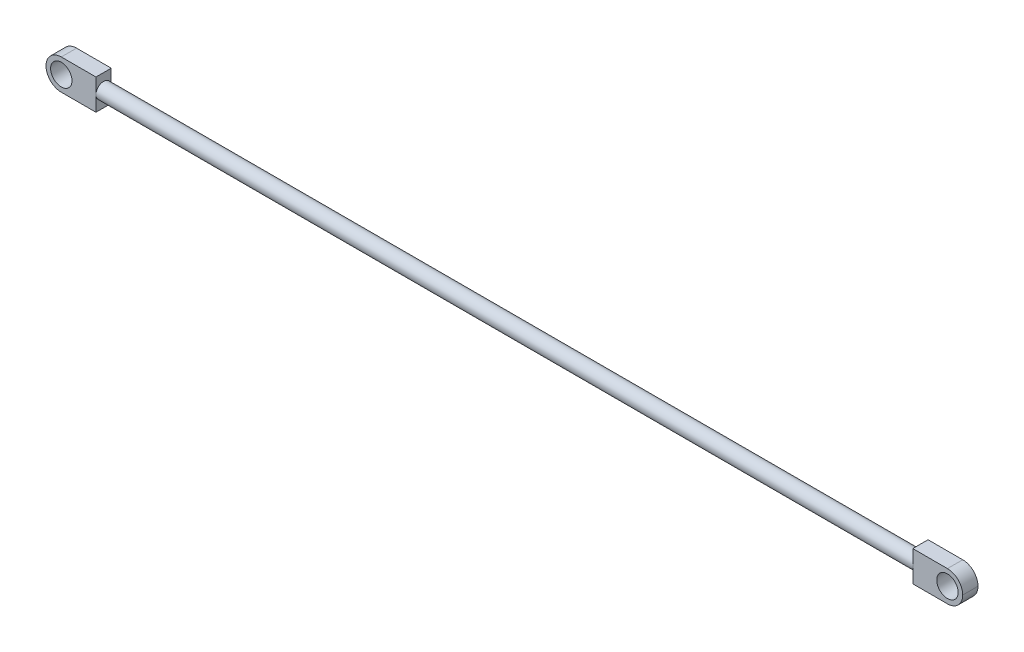
ISO-10303-21;
HEADER;
FILE_DESCRIPTION(('STEP AP214'),'2;1');
FILE_NAME('part.step','',(''),(''),'','','');
FILE_SCHEMA(('AUTOMOTIVE_DESIGN { 1 0 10303 214 1 1 1 1 }'));
ENDSEC;
DATA;
#1=APPLICATION_CONTEXT('core data for automotive mechanical design processes');
#2=APPLICATION_PROTOCOL_DEFINITION('international standard','automotive_design',2000,#1);
#3=PRODUCT_CONTEXT('',#1,'mechanical');
#4=PRODUCT('Part','Part','',(#3));
#5=PRODUCT_RELATED_PRODUCT_CATEGORY('part','',(#4));
#6=PRODUCT_DEFINITION_FORMATION('','',#4);
#7=PRODUCT_DEFINITION_CONTEXT('part definition',#1,'design');
#8=PRODUCT_DEFINITION('design','',#6,#7);
#9=PRODUCT_DEFINITION_SHAPE('','',#8);
#10=(LENGTH_UNIT() NAMED_UNIT(*) SI_UNIT(.MILLI.,.METRE.));
#11=(NAMED_UNIT(*) PLANE_ANGLE_UNIT() SI_UNIT($,.RADIAN.));
#12=(NAMED_UNIT(*) SI_UNIT($,.STERADIAN.) SOLID_ANGLE_UNIT());
#13=UNCERTAINTY_MEASURE_WITH_UNIT(LENGTH_MEASURE(1.E-05),#10,'distance_accuracy_value','');
#14=(GEOMETRIC_REPRESENTATION_CONTEXT(3) GLOBAL_UNCERTAINTY_ASSIGNED_CONTEXT((#13)) GLOBAL_UNIT_ASSIGNED_CONTEXT((#10,
#11,#12)) REPRESENTATION_CONTEXT('',''));
#15=CARTESIAN_POINT('',(0.,0.,0.));
#16=DIRECTION('',(0.,0.,1.));
#17=DIRECTION('',(1.,0.,0.));
#18=AXIS2_PLACEMENT_3D('',#15,#16,#17);
#19=CARTESIAN_POINT('',(267.298147640469,-20.9331098604644,19.));
#20=DIRECTION('',(-1.,0.,0.));
#21=DIRECTION('',(0.,0.,1.));
#22=AXIS2_PLACEMENT_3D('',#19,#20,#21);
#23=PLANE('',#22);
#24=DIRECTION('',(0.,1.,0.));
#25=VECTOR('',#24,1.);
#26=CARTESIAN_POINT('',(267.298147640469,0.,10.));
#27=LINE('',#26,#25);
#28=CARTESIAN_POINT('',(267.298147640469,-10.,10.));
#29=VERTEX_POINT('',#28);
#30=CARTESIAN_POINT('',(267.298147640469,0.,10.));
#31=VERTEX_POINT('',#30);
#32=EDGE_CURVE('E213',#29,#31,#27,.T.);
#33=ORIENTED_EDGE('',*,*,#32,.T.);
#34=CARTESIAN_POINT('',(267.298147640469,0.,5.));
#35=DIRECTION('',(-1.,0.,0.));
#36=DIRECTION('',(0.,0.,1.));
#37=AXIS2_PLACEMENT_3D('',#34,#35,#36);
#38=CIRCLE('',#37,5.);
#39=CARTESIAN_POINT('',(267.298147640469,0.,0.));
#40=VERTEX_POINT('',#39);
#41=EDGE_CURVE('E11',#31,#40,#38,.F.);
#42=ORIENTED_EDGE('',*,*,#41,.T.);
#43=DIRECTION('',(0.,1.,0.));
#44=VECTOR('',#43,1.);
#45=CARTESIAN_POINT('',(267.298147640469,-20.9331098604644,0.));
#46=LINE('',#45,#44);
#47=CARTESIAN_POINT('',(267.298147640469,-10.,0.));
#48=VERTEX_POINT('',#47);
#49=EDGE_CURVE('E198',#48,#40,#46,.T.);
#50=ORIENTED_EDGE('',*,*,#49,.F.);
#51=DIRECTION('',(0.,0.,1.));
#52=VECTOR('',#51,1.);
#53=CARTESIAN_POINT('',(267.298147640469,-10.,10.));
#54=LINE('',#53,#52);
#55=EDGE_CURVE('E178',#48,#29,#54,.T.);
#56=ORIENTED_EDGE('',*,*,#55,.T.);
#57=EDGE_LOOP('',(#33,#42,#50,#56));
#58=FACE_BOUND('',#57,.T.);
#59=ADVANCED_FACE('F35',(#58),#23,.T.);
#60=CARTESIAN_POINT('',(0.,0.,10.));
#61=DIRECTION('',(0.,0.,-1.));
#62=DIRECTION('',(-1.,0.,0.));
#63=AXIS2_PLACEMENT_3D('',#60,#61,#62);
#64=PLANE('',#63);
#65=CARTESIAN_POINT('',(290.,0.,10.));
#66=DIRECTION('',(0.,0.,1.));
#67=DIRECTION('',(1.,0.,0.));
#68=AXIS2_PLACEMENT_3D('',#65,#66,#67);
#69=CIRCLE('',#68,6.99999999999999);
#70=CARTESIAN_POINT('',(297.,0.,10.));
#71=VERTEX_POINT('',#70);
#72=EDGE_CURVE('E185',#71,#71,#69,.T.);
#73=ORIENTED_EDGE('',*,*,#72,.F.);
#74=EDGE_LOOP('',(#73));
#75=FACE_BOUND('',#74,.T.);
#76=ORIENTED_EDGE('',*,*,#32,.F.);
#77=DIRECTION('',(1.,0.,0.));
#78=VECTOR('',#77,1.);
#79=CARTESIAN_POINT('',(-300.,-10.,10.));
#80=LINE('',#79,#78);
#81=CARTESIAN_POINT('',(290.,-10.,10.));
#82=VERTEX_POINT('',#81);
#83=EDGE_CURVE('E177',#29,#82,#80,.T.);
#84=ORIENTED_EDGE('',*,*,#83,.T.);
#85=CARTESIAN_POINT('',(290.,0.,10.));
#86=DIRECTION('',(0.,0.,-1.));
#87=DIRECTION('',(-1.,0.,0.));
#88=AXIS2_PLACEMENT_3D('',#85,#86,#87);
#89=CIRCLE('',#88,10.);
#90=CARTESIAN_POINT('',(300.,0.,10.));
#91=VERTEX_POINT('',#90);
#92=EDGE_CURVE('E193',#82,#91,#89,.F.);
#93=ORIENTED_EDGE('',*,*,#92,.T.);
#94=CARTESIAN_POINT('',(290.,0.,10.));
#95=DIRECTION('',(0.,0.,-1.));
#96=DIRECTION('',(-1.,0.,0.));
#97=AXIS2_PLACEMENT_3D('',#94,#95,#96);
#98=CIRCLE('',#97,10.);
#99=CARTESIAN_POINT('',(290.,10.,10.));
#100=VERTEX_POINT('',#99);
#101=EDGE_CURVE('E190',#91,#100,#98,.F.);
#102=ORIENTED_EDGE('',*,*,#101,.T.);
#103=DIRECTION('',(-1.,0.,0.));
#104=VECTOR('',#103,1.);
#105=CARTESIAN_POINT('',(-300.,10.,10.));
#106=LINE('',#105,#104);
#107=CARTESIAN_POINT('',(267.298147640469,10.,10.));
#108=VERTEX_POINT('',#107);
#109=EDGE_CURVE('E192',#100,#108,#106,.T.);
#110=ORIENTED_EDGE('',*,*,#109,.T.);
#111=EDGE_CURVE('E180',#31,#108,#27,.T.);
#112=ORIENTED_EDGE('',*,*,#111,.F.);
#113=EDGE_LOOP('',(#76,#84,#93,#102,#110,#112));
#114=FACE_BOUND('',#113,.T.);
#115=ADVANCED_FACE('F37',(#75,#114),#64,.F.);
#116=CARTESIAN_POINT('',(0.,0.,0.));
#117=DIRECTION('',(0.,0.,-1.));
#118=DIRECTION('',(-1.,0.,0.));
#119=AXIS2_PLACEMENT_3D('',#116,#117,#118);
#120=PLANE('',#119);
#121=CARTESIAN_POINT('',(290.,0.,0.));
#122=DIRECTION('',(0.,0.,1.));
#123=DIRECTION('',(1.,0.,0.));
#124=AXIS2_PLACEMENT_3D('',#121,#122,#123);
#125=CIRCLE('',#124,6.99999999999999);
#126=CARTESIAN_POINT('',(297.,0.,0.));
#127=VERTEX_POINT('',#126);
#128=EDGE_CURVE('E205',#127,#127,#125,.T.);
#129=ORIENTED_EDGE('',*,*,#128,.T.);
#130=EDGE_LOOP('',(#129));
#131=FACE_BOUND('',#130,.T.);
#132=DIRECTION('',(1.,0.,0.));
#133=VECTOR('',#132,1.);
#134=CARTESIAN_POINT('',(-300.,-10.,0.));
#135=LINE('',#134,#133);
#136=CARTESIAN_POINT('',(290.,-10.,0.));
#137=VERTEX_POINT('',#136);
#138=EDGE_CURVE('E189',#48,#137,#135,.T.);
#139=ORIENTED_EDGE('',*,*,#138,.F.);
#140=ORIENTED_EDGE('',*,*,#49,.T.);
#141=CARTESIAN_POINT('',(267.298147640469,10.,0.));
#142=VERTEX_POINT('',#141);
#143=EDGE_CURVE('E208',#40,#142,#46,.T.);
#144=ORIENTED_EDGE('',*,*,#143,.T.);
#145=DIRECTION('',(-1.,0.,0.));
#146=VECTOR('',#145,1.);
#147=CARTESIAN_POINT('',(-300.,10.,0.));
#148=LINE('',#147,#146);
#149=CARTESIAN_POINT('',(290.,10.,0.));
#150=VERTEX_POINT('',#149);
#151=EDGE_CURVE('E204',#150,#142,#148,.T.);
#152=ORIENTED_EDGE('',*,*,#151,.F.);
#153=CARTESIAN_POINT('',(290.,0.,0.));
#154=DIRECTION('',(0.,0.,-1.));
#155=DIRECTION('',(-1.,0.,0.));
#156=AXIS2_PLACEMENT_3D('',#153,#154,#155);
#157=CIRCLE('',#156,10.);
#158=CARTESIAN_POINT('',(300.,0.,0.));
#159=VERTEX_POINT('',#158);
#160=EDGE_CURVE('E195',#150,#159,#157,.T.);
#161=ORIENTED_EDGE('',*,*,#160,.T.);
#162=CARTESIAN_POINT('',(290.,0.,0.));
#163=DIRECTION('',(0.,0.,-1.));
#164=DIRECTION('',(-1.,0.,0.));
#165=AXIS2_PLACEMENT_3D('',#162,#163,#164);
#166=CIRCLE('',#165,10.);
#167=EDGE_CURVE('E197',#159,#137,#166,.T.);
#168=ORIENTED_EDGE('',*,*,#167,.T.);
#169=EDGE_LOOP('',(#139,#140,#144,#152,#161,#168));
#170=FACE_BOUND('',#169,.T.);
#171=ADVANCED_FACE('F230',(#131,#170),#120,.T.);
#172=CARTESIAN_POINT('',(-300.,10.,10.));
#173=DIRECTION('',(0.,-1.,0.));
#174=DIRECTION('',(0.,0.,-1.));
#175=AXIS2_PLACEMENT_3D('',#172,#173,#174);
#176=PLANE('',#175);
#177=DIRECTION('',(0.,0.,-1.));
#178=VECTOR('',#177,1.);
#179=CARTESIAN_POINT('',(267.298147640469,10.,10.));
#180=LINE('',#179,#178);
#181=EDGE_CURVE('E181',#108,#142,#180,.T.);
#182=ORIENTED_EDGE('',*,*,#181,.F.);
#183=ORIENTED_EDGE('',*,*,#109,.F.);
#184=DIRECTION('',(0.,0.,-1.));
#185=VECTOR('',#184,1.);
#186=CARTESIAN_POINT('',(290.,10.,10.));
#187=LINE('',#186,#185);
#188=EDGE_CURVE('E201',#100,#150,#187,.T.);
#189=ORIENTED_EDGE('',*,*,#188,.T.);
#190=ORIENTED_EDGE('',*,*,#151,.T.);
#191=EDGE_LOOP('',(#182,#183,#189,#190));
#192=FACE_BOUND('',#191,.T.);
#193=ADVANCED_FACE('F225',(#192),#176,.F.);
#194=CARTESIAN_POINT('',(-300.,-10.,10.));
#195=DIRECTION('',(0.,1.,0.));
#196=DIRECTION('',(0.,0.,1.));
#197=AXIS2_PLACEMENT_3D('',#194,#195,#196);
#198=PLANE('',#197);
#199=ORIENTED_EDGE('',*,*,#55,.F.);
#200=ORIENTED_EDGE('',*,*,#138,.T.);
#201=DIRECTION('',(0.,0.,-1.));
#202=VECTOR('',#201,1.);
#203=CARTESIAN_POINT('',(290.,-10.,10.));
#204=LINE('',#203,#202);
#205=EDGE_CURVE('E186',#137,#82,#204,.F.);
#206=ORIENTED_EDGE('',*,*,#205,.T.);
#207=ORIENTED_EDGE('',*,*,#83,.F.);
#208=EDGE_LOOP('',(#199,#200,#206,#207));
#209=FACE_BOUND('',#208,.T.);
#210=ADVANCED_FACE('F242',(#209),#198,.F.);
#211=CARTESIAN_POINT('',(290.,0.,10.));
#212=DIRECTION('',(0.,0.,-1.));
#213=DIRECTION('',(-1.,0.,0.));
#214=AXIS2_PLACEMENT_3D('',#211,#212,#213);
#215=CYLINDRICAL_SURFACE('',#214,6.99999999999999);
#216=ORIENTED_EDGE('',*,*,#72,.T.);
#217=EDGE_LOOP('',(#216));
#218=FACE_BOUND('',#217,.T.);
#219=ORIENTED_EDGE('',*,*,#128,.F.);
#220=EDGE_LOOP('',(#219));
#221=FACE_BOUND('',#220,.T.);
#222=ADVANCED_FACE('F259',(#218,#221),#215,.F.);
#223=CARTESIAN_POINT('',(290.,0.,10.));
#224=DIRECTION('',(0.,0.,-1.));
#225=DIRECTION('',(-1.,0.,0.));
#226=AXIS2_PLACEMENT_3D('',#223,#224,#225);
#227=CYLINDRICAL_SURFACE('',#226,10.);
#228=DIRECTION('',(0.,0.,-1.));
#229=VECTOR('',#228,1.);
#230=CARTESIAN_POINT('',(300.,0.,10.));
#231=LINE('',#230,#229);
#232=EDGE_CURVE('E182',#91,#159,#231,.T.);
#233=ORIENTED_EDGE('',*,*,#232,.F.);
#234=ORIENTED_EDGE('',*,*,#92,.F.);
#235=ORIENTED_EDGE('',*,*,#205,.F.);
#236=ORIENTED_EDGE('',*,*,#167,.F.);
#237=EDGE_LOOP('',(#233,#234,#235,#236));
#238=FACE_BOUND('',#237,.T.);
#239=ADVANCED_FACE('F247',(#238),#227,.T.);
#240=CARTESIAN_POINT('',(290.,0.,10.));
#241=DIRECTION('',(0.,0.,-1.));
#242=DIRECTION('',(-1.,0.,0.));
#243=AXIS2_PLACEMENT_3D('',#240,#241,#242);
#244=CYLINDRICAL_SURFACE('',#243,10.);
#245=ORIENTED_EDGE('',*,*,#101,.F.);
#246=ORIENTED_EDGE('',*,*,#232,.T.);
#247=ORIENTED_EDGE('',*,*,#160,.F.);
#248=ORIENTED_EDGE('',*,*,#188,.F.);
#249=EDGE_LOOP('',(#245,#246,#247,#248));
#250=FACE_BOUND('',#249,.T.);
#251=ADVANCED_FACE('F250',(#250),#244,.T.);
#252=ORIENTED_EDGE('',*,*,#143,.F.);
#253=EDGE_CURVE('E39',#40,#31,#38,.F.);
#254=ORIENTED_EDGE('',*,*,#253,.T.);
#255=ORIENTED_EDGE('',*,*,#111,.T.);
#256=ORIENTED_EDGE('',*,*,#181,.T.);
#257=EDGE_LOOP('',(#252,#254,#255,#256));
#258=FACE_BOUND('',#257,.T.);
#259=ADVANCED_FACE('F234',(#258),#23,.T.);
#260=CARTESIAN_POINT('',(267.701852359531,0.,5.));
#261=DIRECTION('',(-1.,0.,0.));
#262=DIRECTION('',(0.,0.,1.));
#263=AXIS2_PLACEMENT_3D('',#260,#261,#262);
#264=CYLINDRICAL_SURFACE('',#263,5.);
#265=ORIENTED_EDGE('',*,*,#41,.F.);
#266=ORIENTED_EDGE('',*,*,#253,.F.);
#267=EDGE_LOOP('',(#265,#266));
#268=FACE_BOUND('',#267,.T.);
#269=CARTESIAN_POINT('',(-267.298147640469,0.,5.));
#270=DIRECTION('',(1.,0.,0.));
#271=DIRECTION('',(0.,0.,-1.));
#272=AXIS2_PLACEMENT_3D('',#269,#270,#271);
#273=CIRCLE('',#272,5.);
#274=CARTESIAN_POINT('',(-267.298147640469,0.,0.));
#275=VERTEX_POINT('',#274);
#276=CARTESIAN_POINT('',(-267.298147640469,0.,10.));
#277=VERTEX_POINT('',#276);
#278=EDGE_CURVE('E127',#275,#277,#273,.T.);
#279=ORIENTED_EDGE('',*,*,#278,.T.);
#280=EDGE_CURVE('E175',#277,#275,#273,.T.);
#281=ORIENTED_EDGE('',*,*,#280,.T.);
#282=EDGE_LOOP('',(#279,#281));
#283=FACE_BOUND('',#282,.T.);
#284=ADVANCED_FACE('F257',(#268,#283),#264,.T.);
#285=CARTESIAN_POINT('',(-267.298147640469,-20.9331098604644,19.));
#286=DIRECTION('',(1.,0.,0.));
#287=DIRECTION('',(0.,0.,-1.));
#288=AXIS2_PLACEMENT_3D('',#285,#286,#287);
#289=PLANE('',#288);
#290=ORIENTED_EDGE('',*,*,#278,.F.);
#291=DIRECTION('',(0.,-1.,0.));
#292=VECTOR('',#291,1.);
#293=CARTESIAN_POINT('',(-267.298147640469,-20.9331098604644,0.));
#294=LINE('',#293,#292);
#295=CARTESIAN_POINT('',(-267.298147640469,10.,0.));
#296=VERTEX_POINT('',#295);
#297=EDGE_CURVE('E50',#296,#275,#294,.T.);
#298=ORIENTED_EDGE('',*,*,#297,.F.);
#299=DIRECTION('',(0.,0.,1.));
#300=VECTOR('',#299,1.);
#301=CARTESIAN_POINT('',(-267.298147640469,10.,10.));
#302=LINE('',#301,#300);
#303=CARTESIAN_POINT('',(-267.298147640469,10.,10.));
#304=VERTEX_POINT('',#303);
#305=EDGE_CURVE('E124',#296,#304,#302,.T.);
#306=ORIENTED_EDGE('',*,*,#305,.T.);
#307=DIRECTION('',(0.,-1.,0.));
#308=VECTOR('',#307,1.);
#309=CARTESIAN_POINT('',(-267.298147640469,0.,10.));
#310=LINE('',#309,#308);
#311=EDGE_CURVE('E140',#304,#277,#310,.T.);
#312=ORIENTED_EDGE('',*,*,#311,.T.);
#313=EDGE_LOOP('',(#290,#298,#306,#312));
#314=FACE_BOUND('',#313,.T.);
#315=ADVANCED_FACE('F122',(#314),#289,.T.);
#316=ORIENTED_EDGE('',*,*,#280,.F.);
#317=CARTESIAN_POINT('',(-267.298147640469,-10.,10.));
#318=VERTEX_POINT('',#317);
#319=EDGE_CURVE('E129',#277,#318,#310,.T.);
#320=ORIENTED_EDGE('',*,*,#319,.T.);
#321=DIRECTION('',(0.,0.,-1.));
#322=VECTOR('',#321,1.);
#323=CARTESIAN_POINT('',(-267.298147640469,-10.,10.));
#324=LINE('',#323,#322);
#325=CARTESIAN_POINT('',(-267.298147640469,-10.,0.));
#326=VERTEX_POINT('',#325);
#327=EDGE_CURVE('E170',#318,#326,#324,.T.);
#328=ORIENTED_EDGE('',*,*,#327,.T.);
#329=EDGE_CURVE('E130',#275,#326,#294,.T.);
#330=ORIENTED_EDGE('',*,*,#329,.F.);
#331=EDGE_LOOP('',(#316,#320,#328,#330));
#332=FACE_BOUND('',#331,.T.);
#333=ADVANCED_FACE('F331',(#332),#289,.T.);
#334=CARTESIAN_POINT('',(-290.,0.,10.));
#335=DIRECTION('',(0.,0.,-1.));
#336=DIRECTION('',(-1.,0.,0.));
#337=AXIS2_PLACEMENT_3D('',#334,#335,#336);
#338=CYLINDRICAL_SURFACE('',#337,6.99999999999999);
#339=CARTESIAN_POINT('',(-290.,0.,10.));
#340=DIRECTION('',(0.,0.,1.));
#341=DIRECTION('',(1.,0.,0.));
#342=AXIS2_PLACEMENT_3D('',#339,#340,#341);
#343=CIRCLE('',#342,6.99999999999999);
#344=CARTESIAN_POINT('',(-283.,0.,10.));
#345=VERTEX_POINT('',#344);
#346=EDGE_CURVE('E147',#345,#345,#343,.T.);
#347=ORIENTED_EDGE('',*,*,#346,.T.);
#348=EDGE_LOOP('',(#347));
#349=FACE_BOUND('',#348,.T.);
#350=CARTESIAN_POINT('',(-290.,0.,0.));
#351=DIRECTION('',(0.,0.,1.));
#352=DIRECTION('',(1.,0.,0.));
#353=AXIS2_PLACEMENT_3D('',#350,#351,#352);
#354=CIRCLE('',#353,6.99999999999999);
#355=CARTESIAN_POINT('',(-283.,0.,0.));
#356=VERTEX_POINT('',#355);
#357=EDGE_CURVE('E152',#356,#356,#354,.T.);
#358=ORIENTED_EDGE('',*,*,#357,.F.);
#359=EDGE_LOOP('',(#358));
#360=FACE_BOUND('',#359,.T.);
#361=ADVANCED_FACE('F340',(#349,#360),#338,.F.);
#362=CARTESIAN_POINT('',(-290.,0.,10.));
#363=DIRECTION('',(0.,0.,-1.));
#364=DIRECTION('',(-1.,0.,0.));
#365=AXIS2_PLACEMENT_3D('',#362,#363,#364);
#366=CYLINDRICAL_SURFACE('',#365,10.);
#367=DIRECTION('',(0.,0.,-1.));
#368=VECTOR('',#367,1.);
#369=CARTESIAN_POINT('',(-300.,0.,10.));
#370=LINE('',#369,#368);
#371=CARTESIAN_POINT('',(-300.,0.,10.));
#372=VERTEX_POINT('',#371);
#373=CARTESIAN_POINT('',(-300.,0.,0.));
#374=VERTEX_POINT('',#373);
#375=EDGE_CURVE('E139',#372,#374,#370,.T.);
#376=ORIENTED_EDGE('',*,*,#375,.F.);
#377=CARTESIAN_POINT('',(-290.,0.,10.));
#378=DIRECTION('',(0.,0.,-1.));
#379=DIRECTION('',(-1.,0.,0.));
#380=AXIS2_PLACEMENT_3D('',#377,#378,#379);
#381=CIRCLE('',#380,10.);
#382=CARTESIAN_POINT('',(-290.,10.,10.));
#383=VERTEX_POINT('',#382);
#384=EDGE_CURVE('E163',#383,#372,#381,.F.);
#385=ORIENTED_EDGE('',*,*,#384,.F.);
#386=DIRECTION('',(0.,0.,-1.));
#387=VECTOR('',#386,1.);
#388=CARTESIAN_POINT('',(-290.,10.,10.));
#389=LINE('',#388,#387);
#390=CARTESIAN_POINT('',(-290.,10.,0.));
#391=VERTEX_POINT('',#390);
#392=EDGE_CURVE('E158',#391,#383,#389,.F.);
#393=ORIENTED_EDGE('',*,*,#392,.F.);
#394=CARTESIAN_POINT('',(-290.,0.,0.));
#395=DIRECTION('',(0.,0.,-1.));
#396=DIRECTION('',(-1.,0.,0.));
#397=AXIS2_PLACEMENT_3D('',#394,#395,#396);
#398=CIRCLE('',#397,10.);
#399=EDGE_CURVE('E144',#374,#391,#398,.T.);
#400=ORIENTED_EDGE('',*,*,#399,.F.);
#401=EDGE_LOOP('',(#376,#385,#393,#400));
#402=FACE_BOUND('',#401,.T.);
#403=ADVANCED_FACE('F349',(#402),#366,.T.);
#404=CARTESIAN_POINT('',(-290.,0.,10.));
#405=DIRECTION('',(0.,0.,-1.));
#406=DIRECTION('',(-1.,0.,0.));
#407=AXIS2_PLACEMENT_3D('',#404,#405,#406);
#408=CYLINDRICAL_SURFACE('',#407,10.);
#409=CARTESIAN_POINT('',(-290.,0.,10.));
#410=DIRECTION('',(0.,0.,-1.));
#411=DIRECTION('',(-1.,0.,0.));
#412=AXIS2_PLACEMENT_3D('',#409,#410,#411);
#413=CIRCLE('',#412,10.);
#414=CARTESIAN_POINT('',(-290.,-10.,10.));
#415=VERTEX_POINT('',#414);
#416=EDGE_CURVE('E165',#372,#415,#413,.F.);
#417=ORIENTED_EDGE('',*,*,#416,.F.);
#418=ORIENTED_EDGE('',*,*,#375,.T.);
#419=CARTESIAN_POINT('',(-290.,0.,0.));
#420=DIRECTION('',(0.,0.,-1.));
#421=DIRECTION('',(-1.,0.,0.));
#422=AXIS2_PLACEMENT_3D('',#419,#420,#421);
#423=CIRCLE('',#422,10.);
#424=CARTESIAN_POINT('',(-290.,-10.,0.));
#425=VERTEX_POINT('',#424);
#426=EDGE_CURVE('E161',#425,#374,#423,.T.);
#427=ORIENTED_EDGE('',*,*,#426,.F.);
#428=DIRECTION('',(0.,0.,-1.));
#429=VECTOR('',#428,1.);
#430=CARTESIAN_POINT('',(-290.,-10.,10.));
#431=LINE('',#430,#429);
#432=EDGE_CURVE('E167',#415,#425,#431,.T.);
#433=ORIENTED_EDGE('',*,*,#432,.F.);
#434=EDGE_LOOP('',(#417,#418,#427,#433));
#435=FACE_BOUND('',#434,.T.);
#436=ADVANCED_FACE('F359',(#435),#408,.T.);
#437=CARTESIAN_POINT('',(-300.,-10.,10.));
#438=DIRECTION('',(0.,1.,0.));
#439=DIRECTION('',(0.,0.,1.));
#440=AXIS2_PLACEMENT_3D('',#437,#438,#439);
#441=PLANE('',#440);
#442=ORIENTED_EDGE('',*,*,#327,.F.);
#443=DIRECTION('',(1.,0.,0.));
#444=VECTOR('',#443,1.);
#445=CARTESIAN_POINT('',(-300.,-10.,10.));
#446=LINE('',#445,#444);
#447=EDGE_CURVE('E155',#415,#318,#446,.T.);
#448=ORIENTED_EDGE('',*,*,#447,.F.);
#449=ORIENTED_EDGE('',*,*,#432,.T.);
#450=DIRECTION('',(1.,0.,0.));
#451=VECTOR('',#450,1.);
#452=CARTESIAN_POINT('',(-300.,-10.,0.));
#453=LINE('',#452,#451);
#454=EDGE_CURVE('E146',#425,#326,#453,.T.);
#455=ORIENTED_EDGE('',*,*,#454,.T.);
#456=EDGE_LOOP('',(#442,#448,#449,#455));
#457=FACE_BOUND('',#456,.T.);
#458=ADVANCED_FACE('F369',(#457),#441,.F.);
#459=CARTESIAN_POINT('',(-300.,10.,10.));
#460=DIRECTION('',(0.,-1.,0.));
#461=DIRECTION('',(0.,0.,-1.));
#462=AXIS2_PLACEMENT_3D('',#459,#460,#461);
#463=PLANE('',#462);
#464=ORIENTED_EDGE('',*,*,#305,.F.);
#465=DIRECTION('',(-1.,0.,0.));
#466=VECTOR('',#465,1.);
#467=CARTESIAN_POINT('',(-300.,10.,0.));
#468=LINE('',#467,#466);
#469=EDGE_CURVE('E136',#296,#391,#468,.T.);
#470=ORIENTED_EDGE('',*,*,#469,.T.);
#471=ORIENTED_EDGE('',*,*,#392,.T.);
#472=DIRECTION('',(-1.,0.,0.));
#473=VECTOR('',#472,1.);
#474=CARTESIAN_POINT('',(-300.,10.,10.));
#475=LINE('',#474,#473);
#476=EDGE_CURVE('E138',#304,#383,#475,.T.);
#477=ORIENTED_EDGE('',*,*,#476,.F.);
#478=EDGE_LOOP('',(#464,#470,#471,#477));
#479=FACE_BOUND('',#478,.T.);
#480=ADVANCED_FACE('F134',(#479),#463,.F.);
#481=CARTESIAN_POINT('',(0.,0.,0.));
#482=DIRECTION('',(0.,0.,-1.));
#483=DIRECTION('',(-1.,0.,0.));
#484=AXIS2_PLACEMENT_3D('',#481,#482,#483);
#485=PLANE('',#484);
#486=ORIENTED_EDGE('',*,*,#357,.T.);
#487=EDGE_LOOP('',(#486));
#488=FACE_BOUND('',#487,.T.);
#489=ORIENTED_EDGE('',*,*,#469,.F.);
#490=ORIENTED_EDGE('',*,*,#297,.T.);
#491=ORIENTED_EDGE('',*,*,#329,.T.);
#492=ORIENTED_EDGE('',*,*,#454,.F.);
#493=ORIENTED_EDGE('',*,*,#426,.T.);
#494=ORIENTED_EDGE('',*,*,#399,.T.);
#495=EDGE_LOOP('',(#489,#490,#491,#492,#493,#494));
#496=FACE_BOUND('',#495,.T.);
#497=ADVANCED_FACE('F142',(#488,#496),#485,.T.);
#498=CARTESIAN_POINT('',(0.,0.,10.));
#499=DIRECTION('',(0.,0.,-1.));
#500=DIRECTION('',(-1.,0.,0.));
#501=AXIS2_PLACEMENT_3D('',#498,#499,#500);
#502=PLANE('',#501);
#503=ORIENTED_EDGE('',*,*,#346,.F.);
#504=EDGE_LOOP('',(#503));
#505=FACE_BOUND('',#504,.T.);
#506=ORIENTED_EDGE('',*,*,#311,.F.);
#507=ORIENTED_EDGE('',*,*,#476,.T.);
#508=ORIENTED_EDGE('',*,*,#384,.T.);
#509=ORIENTED_EDGE('',*,*,#416,.T.);
#510=ORIENTED_EDGE('',*,*,#447,.T.);
#511=ORIENTED_EDGE('',*,*,#319,.F.);
#512=EDGE_LOOP('',(#506,#507,#508,#509,#510,#511));
#513=FACE_BOUND('',#512,.T.);
#514=ADVANCED_FACE('F396',(#505,#513),#502,.F.);
#515=CLOSED_SHELL('',(#59,#115,#171,#193,#210,#222,#239,#251,#259,#284,#315,#333,#361,#403,#436,
#458,#480,#497,#514));
#516=MANIFOLD_SOLID_BREP('B2',#515);
#517=ADVANCED_BREP_SHAPE_REPRESENTATION('',(#18,#516),#14);
#518=SHAPE_DEFINITION_REPRESENTATION(#9,#517);
ENDSEC;
END-ISO-10303-21;
